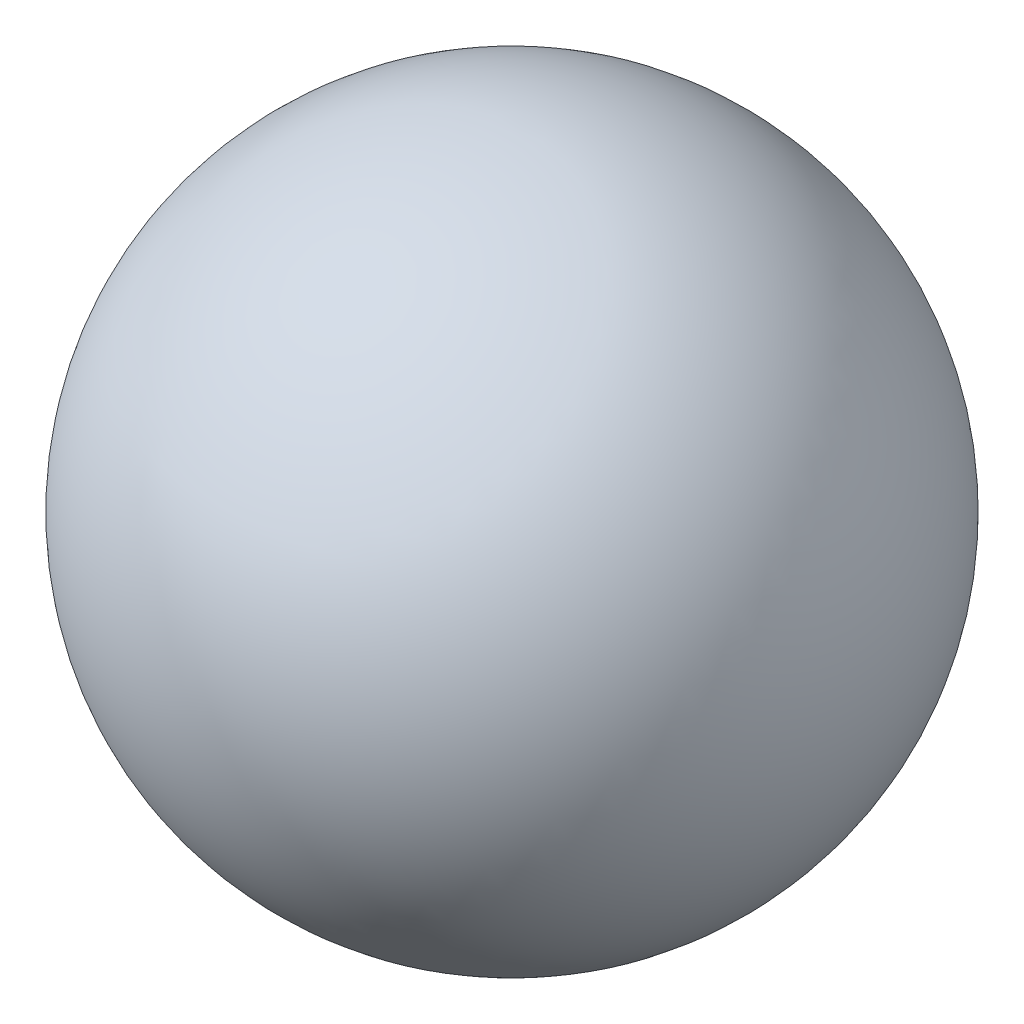
ISO-10303-21;
HEADER;
FILE_DESCRIPTION(('STEP AP214'),'2;1');
FILE_NAME('part.step','',(''),(''),'','','');
FILE_SCHEMA(('AUTOMOTIVE_DESIGN { 1 0 10303 214 1 1 1 1 }'));
ENDSEC;
DATA;
#1=APPLICATION_CONTEXT('core data for automotive mechanical design processes');
#2=APPLICATION_PROTOCOL_DEFINITION('international standard','automotive_design',2000,#1);
#3=PRODUCT_CONTEXT('',#1,'mechanical');
#4=PRODUCT('Part','Part','',(#3));
#5=PRODUCT_RELATED_PRODUCT_CATEGORY('part','',(#4));
#6=PRODUCT_DEFINITION_FORMATION('','',#4);
#7=PRODUCT_DEFINITION_CONTEXT('part definition',#1,'design');
#8=PRODUCT_DEFINITION('design','',#6,#7);
#9=PRODUCT_DEFINITION_SHAPE('','',#8);
#10=(LENGTH_UNIT() NAMED_UNIT(*) SI_UNIT(.MILLI.,.METRE.));
#11=(NAMED_UNIT(*) PLANE_ANGLE_UNIT() SI_UNIT($,.RADIAN.));
#12=(NAMED_UNIT(*) SI_UNIT($,.STERADIAN.) SOLID_ANGLE_UNIT());
#13=UNCERTAINTY_MEASURE_WITH_UNIT(LENGTH_MEASURE(1.E-05),#10,'distance_accuracy_value','');
#14=(GEOMETRIC_REPRESENTATION_CONTEXT(3) GLOBAL_UNCERTAINTY_ASSIGNED_CONTEXT((#13)) GLOBAL_UNIT_ASSIGNED_CONTEXT((#10,
#11,#12)) REPRESENTATION_CONTEXT('',''));
#15=CARTESIAN_POINT('',(0.,0.,0.));
#16=DIRECTION('',(0.,0.,1.));
#17=DIRECTION('',(1.,0.,0.));
#18=AXIS2_PLACEMENT_3D('',#15,#16,#17);
#19=CARTESIAN_POINT('',(0.,165.1,0.));
#20=DIRECTION('',(0.,-1.,0.));
#21=DIRECTION('',(-1.,0.,0.));
#22=AXIS2_PLACEMENT_3D('',#19,#20,#21);
#23=SPHERICAL_SURFACE('',#22,165.1);
#24=CARTESIAN_POINT('',(0.,0.,0.));
#25=VERTEX_POINT('',#24);
#26=VERTEX_LOOP('',#25);
#27=FACE_BOUND('',#26,.T.);
#28=ADVANCED_FACE('F28',(#27),#23,.T.);
#29=CLOSED_SHELL('',(#28));
#30=MANIFOLD_SOLID_BREP('B2',#29);
#31=ADVANCED_BREP_SHAPE_REPRESENTATION('',(#18,#30),#14);
#32=SHAPE_DEFINITION_REPRESENTATION(#9,#31);
ENDSEC;
END-ISO-10303-21;
